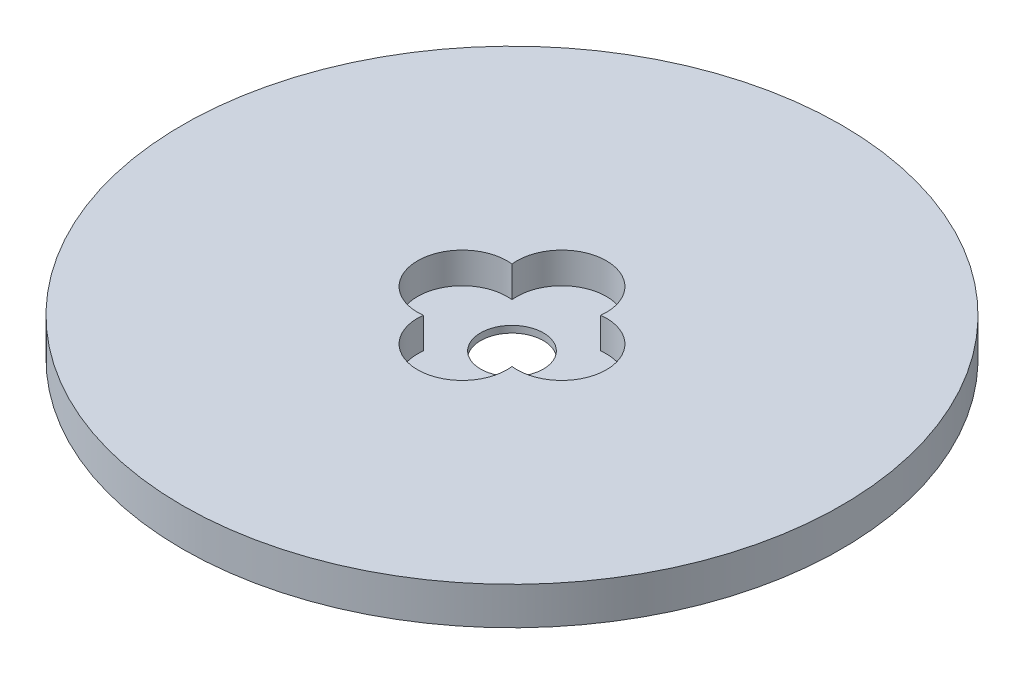
ISO-10303-21;
HEADER;
FILE_DESCRIPTION(('STEP AP214'),'2;1');
FILE_NAME('part.step','',(''),(''),'','','');
FILE_SCHEMA(('AUTOMOTIVE_DESIGN { 1 0 10303 214 1 1 1 1 }'));
ENDSEC;
DATA;
#1=APPLICATION_CONTEXT('core data for automotive mechanical design processes');
#2=APPLICATION_PROTOCOL_DEFINITION('international standard','automotive_design',2000,#1);
#3=PRODUCT_CONTEXT('',#1,'mechanical');
#4=PRODUCT('Part','Part','',(#3));
#5=PRODUCT_RELATED_PRODUCT_CATEGORY('part','',(#4));
#6=PRODUCT_DEFINITION_FORMATION('','',#4);
#7=PRODUCT_DEFINITION_CONTEXT('part definition',#1,'design');
#8=PRODUCT_DEFINITION('design','',#6,#7);
#9=PRODUCT_DEFINITION_SHAPE('','',#8);
#10=(LENGTH_UNIT() NAMED_UNIT(*) SI_UNIT(.MILLI.,.METRE.));
#11=(NAMED_UNIT(*) PLANE_ANGLE_UNIT() SI_UNIT($,.RADIAN.));
#12=(NAMED_UNIT(*) SI_UNIT($,.STERADIAN.) SOLID_ANGLE_UNIT());
#13=UNCERTAINTY_MEASURE_WITH_UNIT(LENGTH_MEASURE(1.E-05),#10,'distance_accuracy_value','');
#14=(GEOMETRIC_REPRESENTATION_CONTEXT(3) GLOBAL_UNCERTAINTY_ASSIGNED_CONTEXT((#13)) GLOBAL_UNIT_ASSIGNED_CONTEXT((#10,
#11,#12)) REPRESENTATION_CONTEXT('',''));
#15=CARTESIAN_POINT('',(0.,0.,0.));
#16=DIRECTION('',(0.,0.,1.));
#17=DIRECTION('',(1.,0.,0.));
#18=AXIS2_PLACEMENT_3D('',#15,#16,#17);
#19=CARTESIAN_POINT('',(0.,6.,0.));
#20=DIRECTION('',(0.,-1.,0.));
#21=DIRECTION('',(0.,0.,-1.));
#22=AXIS2_PLACEMENT_3D('',#19,#20,#21);
#23=CYLINDRICAL_SURFACE('',#22,5.);
#24=CARTESIAN_POINT('',(0.,0.,0.));
#25=DIRECTION('',(0.,1.,0.));
#26=DIRECTION('',(0.,0.,1.));
#27=AXIS2_PLACEMENT_3D('',#24,#25,#26);
#28=CIRCLE('',#27,5.);
#29=CARTESIAN_POINT('',(0.,0.,5.));
#30=VERTEX_POINT('',#29);
#31=EDGE_CURVE('E113',#30,#30,#28,.T.);
#32=ORIENTED_EDGE('',*,*,#31,.F.);
#33=EDGE_LOOP('',(#32));
#34=FACE_BOUND('',#33,.T.);
#35=CARTESIAN_POINT('',(0.,1.07597442446032,0.));
#36=DIRECTION('',(0.,1.,0.));
#37=DIRECTION('',(0.,0.,1.));
#38=AXIS2_PLACEMENT_3D('',#35,#36,#37);
#39=CIRCLE('',#38,5.);
#40=CARTESIAN_POINT('',(0.,1.07597442446032,5.));
#41=VERTEX_POINT('',#40);
#42=EDGE_CURVE('E11',#41,#41,#39,.T.);
#43=ORIENTED_EDGE('',*,*,#42,.T.);
#44=EDGE_LOOP('',(#43));
#45=FACE_BOUND('',#44,.T.);
#46=ADVANCED_FACE('F39',(#34,#45),#23,.F.);
#47=CARTESIAN_POINT('',(0.,6.,0.));
#48=DIRECTION('',(0.,-1.,0.));
#49=DIRECTION('',(0.,0.,-1.));
#50=AXIS2_PLACEMENT_3D('',#47,#48,#49);
#51=CYLINDRICAL_SURFACE('',#50,52.5);
#52=CARTESIAN_POINT('',(0.,6.,0.));
#53=DIRECTION('',(0.,1.,0.));
#54=DIRECTION('',(0.,0.,1.));
#55=AXIS2_PLACEMENT_3D('',#52,#53,#54);
#56=CIRCLE('',#55,52.5);
#57=CARTESIAN_POINT('',(0.,6.,52.5));
#58=VERTEX_POINT('',#57);
#59=EDGE_CURVE('E50',#58,#58,#56,.T.);
#60=ORIENTED_EDGE('',*,*,#59,.F.);
#61=EDGE_LOOP('',(#60));
#62=FACE_BOUND('',#61,.T.);
#63=CARTESIAN_POINT('',(0.,0.,0.));
#64=DIRECTION('',(0.,1.,0.));
#65=DIRECTION('',(0.,0.,1.));
#66=AXIS2_PLACEMENT_3D('',#63,#64,#65);
#67=CIRCLE('',#66,52.5);
#68=CARTESIAN_POINT('',(0.,0.,52.5));
#69=VERTEX_POINT('',#68);
#70=EDGE_CURVE('E119',#69,#69,#67,.T.);
#71=ORIENTED_EDGE('',*,*,#70,.T.);
#72=EDGE_LOOP('',(#71));
#73=FACE_BOUND('',#72,.T.);
#74=ADVANCED_FACE('F41',(#62,#73),#51,.T.);
#75=CARTESIAN_POINT('',(0.,6.,0.));
#76=DIRECTION('',(0.,1.,0.));
#77=DIRECTION('',(0.,0.,1.));
#78=AXIS2_PLACEMENT_3D('',#75,#76,#77);
#79=PLANE('',#78);
#80=CARTESIAN_POINT('',(0.,6.,7.92201036901531));
#81=DIRECTION('',(0.,1.,0.));
#82=DIRECTION('',(1.,0.,0.));
#83=AXIS2_PLACEMENT_3D('',#80,#81,#82);
#84=CIRCLE('',#83,7.12037928552683);
#85=CARTESIAN_POINT('',(-7.06911369503026,6.,7.06911369503029));
#86=VERTEX_POINT('',#85);
#87=CARTESIAN_POINT('',(7.06911369503032,6.,7.06911369503029));
#88=VERTEX_POINT('',#87);
#89=EDGE_CURVE('E110',#86,#88,#84,.T.);
#90=ORIENTED_EDGE('',*,*,#89,.F.);
#91=CARTESIAN_POINT('',(-7.92201036901531,6.,0.));
#92=DIRECTION('',(0.,1.,0.));
#93=DIRECTION('',(0.,0.,1.));
#94=AXIS2_PLACEMENT_3D('',#91,#92,#93);
#95=CIRCLE('',#94,7.12037928552683);
#96=CARTESIAN_POINT('',(-7.06911369503038,6.,-7.0691136950303));
#97=VERTEX_POINT('',#96);
#98=EDGE_CURVE('E115',#97,#86,#95,.T.);
#99=ORIENTED_EDGE('',*,*,#98,.F.);
#100=CARTESIAN_POINT('',(0.,6.,-7.92201036901531));
#101=DIRECTION('',(0.,1.,0.));
#102=DIRECTION('',(-1.,0.,0.));
#103=AXIS2_PLACEMENT_3D('',#100,#101,#102);
#104=CIRCLE('',#103,7.12037928552683);
#105=CARTESIAN_POINT('',(7.06911369503021,6.,-7.06911369503028));
#106=VERTEX_POINT('',#105);
#107=EDGE_CURVE('E53',#106,#97,#104,.T.);
#108=ORIENTED_EDGE('',*,*,#107,.F.);
#109=CARTESIAN_POINT('',(7.92201036901531,6.,0.));
#110=DIRECTION('',(0.,1.,0.));
#111=DIRECTION('',(0.,0.,-1.));
#112=AXIS2_PLACEMENT_3D('',#109,#110,#111);
#113=CIRCLE('',#112,7.12037928552683);
#114=EDGE_CURVE('E94',#88,#106,#113,.T.);
#115=ORIENTED_EDGE('',*,*,#114,.F.);
#116=EDGE_LOOP('',(#90,#99,#108,#115));
#117=FACE_BOUND('',#116,.T.);
#118=ORIENTED_EDGE('',*,*,#59,.T.);
#119=EDGE_LOOP('',(#118));
#120=FACE_BOUND('',#119,.T.);
#121=ADVANCED_FACE('F129',(#117,#120),#79,.T.);
#122=CARTESIAN_POINT('',(0.,0.,0.));
#123=DIRECTION('',(0.,1.,0.));
#124=DIRECTION('',(0.,0.,1.));
#125=AXIS2_PLACEMENT_3D('',#122,#123,#124);
#126=PLANE('',#125);
#127=ORIENTED_EDGE('',*,*,#31,.T.);
#128=EDGE_LOOP('',(#127));
#129=FACE_BOUND('',#128,.T.);
#130=ORIENTED_EDGE('',*,*,#70,.F.);
#131=EDGE_LOOP('',(#130));
#132=FACE_BOUND('',#131,.T.);
#133=ADVANCED_FACE('F127',(#129,#132),#126,.F.);
#134=CARTESIAN_POINT('',(-7.92201036901531,1.07597442446032,0.));
#135=DIRECTION('',(0.,1.,0.));
#136=DIRECTION('',(0.,0.,1.));
#137=AXIS2_PLACEMENT_3D('',#134,#135,#136);
#138=CYLINDRICAL_SURFACE('',#137,7.12037928552683);
#139=ORIENTED_EDGE('',*,*,#98,.T.);
#140=DIRECTION('',(0.,1.,0.));
#141=VECTOR('',#140,1.);
#142=CARTESIAN_POINT('',(-7.06911369503026,3.53798721223016,7.06911369503029));
#143=LINE('',#142,#141);
#144=CARTESIAN_POINT('',(-7.06911369503026,1.07597442446032,7.06911369503029));
#145=VERTEX_POINT('',#144);
#146=EDGE_CURVE('E65',#86,#145,#143,.F.);
#147=ORIENTED_EDGE('',*,*,#146,.T.);
#148=CARTESIAN_POINT('',(-7.92201036901531,1.07597442446032,0.));
#149=DIRECTION('',(0.,1.,0.));
#150=DIRECTION('',(0.,0.,1.));
#151=AXIS2_PLACEMENT_3D('',#148,#149,#150);
#152=CIRCLE('',#151,7.12037928552683);
#153=CARTESIAN_POINT('',(-7.06911369503037,1.07597442446032,-7.0691136950303));
#154=VERTEX_POINT('',#153);
#155=EDGE_CURVE('E114',#154,#145,#152,.T.);
#156=ORIENTED_EDGE('',*,*,#155,.F.);
#157=DIRECTION('',(0.,1.,0.));
#158=VECTOR('',#157,1.);
#159=CARTESIAN_POINT('',(-7.06911369503037,3.53798721223016,-7.0691136950303));
#160=LINE('',#159,#158);
#161=EDGE_CURVE('E101',#154,#97,#160,.T.);
#162=ORIENTED_EDGE('',*,*,#161,.T.);
#163=EDGE_LOOP('',(#139,#147,#156,#162));
#164=FACE_BOUND('',#163,.T.);
#165=ADVANCED_FACE('F126',(#164),#138,.F.);
#166=CARTESIAN_POINT('',(-7.92201036901531,1.07597442446032,0.));
#167=DIRECTION('',(0.,1.,0.));
#168=DIRECTION('',(0.,0.,1.));
#169=AXIS2_PLACEMENT_3D('',#166,#167,#168);
#170=PLANE('',#169);
#171=ORIENTED_EDGE('',*,*,#155,.T.);
#172=CARTESIAN_POINT('',(0.,1.07597442446032,7.92201036901531));
#173=DIRECTION('',(0.,1.,0.));
#174=DIRECTION('',(1.,0.,0.));
#175=AXIS2_PLACEMENT_3D('',#172,#173,#174);
#176=CIRCLE('',#175,7.12037928552683);
#177=CARTESIAN_POINT('',(7.06911369503032,1.07597442446032,7.06911369503029));
#178=VERTEX_POINT('',#177);
#179=EDGE_CURVE('E90',#145,#178,#176,.T.);
#180=ORIENTED_EDGE('',*,*,#179,.T.);
#181=CARTESIAN_POINT('',(7.92201036901531,1.07597442446032,0.));
#182=DIRECTION('',(0.,1.,0.));
#183=DIRECTION('',(0.,0.,-1.));
#184=AXIS2_PLACEMENT_3D('',#181,#182,#183);
#185=CIRCLE('',#184,7.12037928552683);
#186=CARTESIAN_POINT('',(7.06911369503021,1.07597442446032,-7.06911369503028));
#187=VERTEX_POINT('',#186);
#188=EDGE_CURVE('E81',#178,#187,#185,.T.);
#189=ORIENTED_EDGE('',*,*,#188,.T.);
#190=CARTESIAN_POINT('',(0.,1.07597442446032,-7.92201036901531));
#191=DIRECTION('',(0.,1.,0.));
#192=DIRECTION('',(-1.,0.,0.));
#193=AXIS2_PLACEMENT_3D('',#190,#191,#192);
#194=CIRCLE('',#193,7.12037928552683);
#195=EDGE_CURVE('E87',#187,#154,#194,.T.);
#196=ORIENTED_EDGE('',*,*,#195,.T.);
#197=EDGE_LOOP('',(#171,#180,#189,#196));
#198=FACE_BOUND('',#197,.T.);
#199=ORIENTED_EDGE('',*,*,#42,.F.);
#200=EDGE_LOOP('',(#199));
#201=FACE_BOUND('',#200,.T.);
#202=ADVANCED_FACE('F83',(#198,#201),#170,.T.);
#203=CARTESIAN_POINT('',(0.,1.07597442446032,7.92201036901531));
#204=DIRECTION('',(0.,1.,0.));
#205=DIRECTION('',(0.,0.,1.));
#206=AXIS2_PLACEMENT_3D('',#203,#204,#205);
#207=CYLINDRICAL_SURFACE('',#206,7.12037928552683);
#208=ORIENTED_EDGE('',*,*,#89,.T.);
#209=DIRECTION('',(0.,1.,0.));
#210=VECTOR('',#209,1.);
#211=CARTESIAN_POINT('',(7.06911369503032,3.53798721223016,7.06911369503029));
#212=LINE('',#211,#210);
#213=EDGE_CURVE('E91',#88,#178,#212,.F.);
#214=ORIENTED_EDGE('',*,*,#213,.T.);
#215=ORIENTED_EDGE('',*,*,#179,.F.);
#216=ORIENTED_EDGE('',*,*,#146,.F.);
#217=EDGE_LOOP('',(#208,#214,#215,#216));
#218=FACE_BOUND('',#217,.T.);
#219=ADVANCED_FACE('F151',(#218),#207,.F.);
#220=CARTESIAN_POINT('',(0.,1.07597442446032,-7.92201036901531));
#221=DIRECTION('',(0.,1.,0.));
#222=DIRECTION('',(0.,0.,1.));
#223=AXIS2_PLACEMENT_3D('',#220,#221,#222);
#224=CYLINDRICAL_SURFACE('',#223,7.12037928552683);
#225=ORIENTED_EDGE('',*,*,#195,.F.);
#226=DIRECTION('',(0.,1.,0.));
#227=VECTOR('',#226,1.);
#228=CARTESIAN_POINT('',(7.06911369503021,3.53798721223016,-7.06911369503028));
#229=LINE('',#228,#227);
#230=EDGE_CURVE('E96',#106,#187,#229,.F.);
#231=ORIENTED_EDGE('',*,*,#230,.F.);
#232=ORIENTED_EDGE('',*,*,#107,.T.);
#233=ORIENTED_EDGE('',*,*,#161,.F.);
#234=EDGE_LOOP('',(#225,#231,#232,#233));
#235=FACE_BOUND('',#234,.T.);
#236=ADVANCED_FACE('F99',(#235),#224,.F.);
#237=CARTESIAN_POINT('',(7.92201036901531,1.07597442446032,0.));
#238=DIRECTION('',(0.,1.,0.));
#239=DIRECTION('',(0.,0.,1.));
#240=AXIS2_PLACEMENT_3D('',#237,#238,#239);
#241=CYLINDRICAL_SURFACE('',#240,7.12037928552683);
#242=ORIENTED_EDGE('',*,*,#114,.T.);
#243=ORIENTED_EDGE('',*,*,#230,.T.);
#244=ORIENTED_EDGE('',*,*,#188,.F.);
#245=ORIENTED_EDGE('',*,*,#213,.F.);
#246=EDGE_LOOP('',(#242,#243,#244,#245));
#247=FACE_BOUND('',#246,.T.);
#248=ADVANCED_FACE('F100',(#247),#241,.F.);
#249=CLOSED_SHELL('',(#46,#74,#121,#133,#165,#202,#219,#236,#248));
#250=MANIFOLD_SOLID_BREP('B2',#249);
#251=ADVANCED_BREP_SHAPE_REPRESENTATION('',(#18,#250),#14);
#252=SHAPE_DEFINITION_REPRESENTATION(#9,#251);
ENDSEC;
END-ISO-10303-21;
